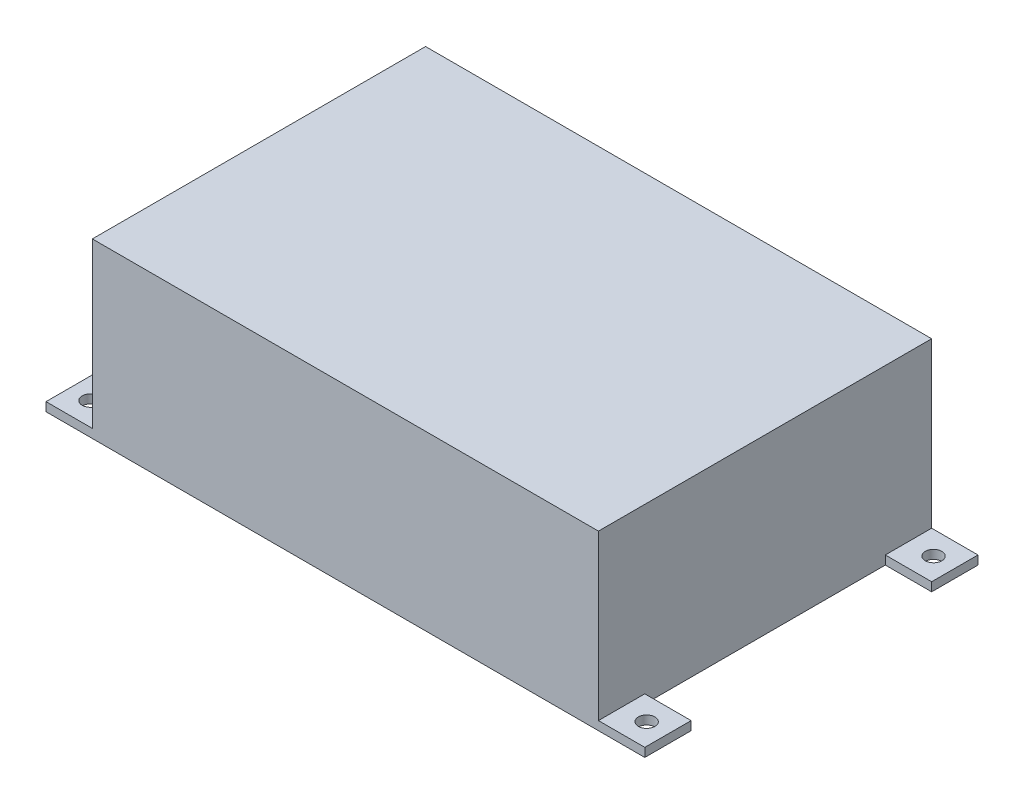
ISO-10303-21;
HEADER;
FILE_DESCRIPTION(('STEP AP214'),'2;1');
FILE_NAME('part.step','',(''),(''),'','','');
FILE_SCHEMA(('AUTOMOTIVE_DESIGN { 1 0 10303 214 1 1 1 1 }'));
ENDSEC;
DATA;
#1=APPLICATION_CONTEXT('core data for automotive mechanical design processes');
#2=APPLICATION_PROTOCOL_DEFINITION('international standard','automotive_design',2000,#1);
#3=PRODUCT_CONTEXT('',#1,'mechanical');
#4=PRODUCT('Part','Part','',(#3));
#5=PRODUCT_RELATED_PRODUCT_CATEGORY('part','',(#4));
#6=PRODUCT_DEFINITION_FORMATION('','',#4);
#7=PRODUCT_DEFINITION_CONTEXT('part definition',#1,'design');
#8=PRODUCT_DEFINITION('design','',#6,#7);
#9=PRODUCT_DEFINITION_SHAPE('','',#8);
#10=(LENGTH_UNIT() NAMED_UNIT(*) SI_UNIT(.MILLI.,.METRE.));
#11=(NAMED_UNIT(*) PLANE_ANGLE_UNIT() SI_UNIT($,.RADIAN.));
#12=(NAMED_UNIT(*) SI_UNIT($,.STERADIAN.) SOLID_ANGLE_UNIT());
#13=UNCERTAINTY_MEASURE_WITH_UNIT(LENGTH_MEASURE(1.E-05),#10,'distance_accuracy_value','');
#14=(GEOMETRIC_REPRESENTATION_CONTEXT(3) GLOBAL_UNCERTAINTY_ASSIGNED_CONTEXT((#13)) GLOBAL_UNIT_ASSIGNED_CONTEXT((#10,
#11,#12)) REPRESENTATION_CONTEXT('',''));
#15=CARTESIAN_POINT('',(0.,0.,0.));
#16=DIRECTION('',(0.,0.,1.));
#17=DIRECTION('',(1.,0.,0.));
#18=AXIS2_PLACEMENT_3D('',#15,#16,#17);
#19=CARTESIAN_POINT('',(202.,69.,0.));
#20=DIRECTION('',(-1.,0.,0.));
#21=DIRECTION('',(0.,0.,1.));
#22=AXIS2_PLACEMENT_3D('',#19,#20,#21);
#23=PLANE('',#22);
#24=DIRECTION('',(0.,-1.,0.));
#25=VECTOR('',#24,1.);
#26=CARTESIAN_POINT('',(202.,3.5,-114.5));
#27=LINE('',#26,#25);
#28=CARTESIAN_POINT('',(202.,3.5,-114.5));
#29=VERTEX_POINT('',#28);
#30=CARTESIAN_POINT('',(202.,0.,-114.5));
#31=VERTEX_POINT('',#30);
#32=EDGE_CURVE('E52',#29,#31,#27,.T.);
#33=ORIENTED_EDGE('',*,*,#32,.F.);
#34=DIRECTION('',(0.,0.,1.));
#35=VECTOR('',#34,1.);
#36=CARTESIAN_POINT('',(202.,3.5,-133.));
#37=LINE('',#36,#35);
#38=CARTESIAN_POINT('',(202.,3.5,-133.));
#39=VERTEX_POINT('',#38);
#40=EDGE_CURVE('E57',#39,#29,#37,.T.);
#41=ORIENTED_EDGE('',*,*,#40,.F.);
#42=DIRECTION('',(0.,-1.,0.));
#43=VECTOR('',#42,1.);
#44=CARTESIAN_POINT('',(202.,69.,-133.));
#45=LINE('',#44,#43);
#46=CARTESIAN_POINT('',(202.,69.,-133.));
#47=VERTEX_POINT('',#46);
#48=EDGE_CURVE('E301',#47,#39,#45,.T.);
#49=ORIENTED_EDGE('',*,*,#48,.F.);
#50=DIRECTION('',(0.,0.,-1.));
#51=VECTOR('',#50,1.);
#52=CARTESIAN_POINT('',(202.,69.,0.));
#53=LINE('',#52,#51);
#54=CARTESIAN_POINT('',(202.,69.,0.));
#55=VERTEX_POINT('',#54);
#56=EDGE_CURVE('E302',#55,#47,#53,.T.);
#57=ORIENTED_EDGE('',*,*,#56,.F.);
#58=DIRECTION('',(0.,-1.,0.));
#59=VECTOR('',#58,1.);
#60=CARTESIAN_POINT('',(202.,69.,0.));
#61=LINE('',#60,#59);
#62=CARTESIAN_POINT('',(202.,3.5,0.));
#63=VERTEX_POINT('',#62);
#64=EDGE_CURVE('E44',#55,#63,#61,.T.);
#65=ORIENTED_EDGE('',*,*,#64,.T.);
#66=DIRECTION('',(0.,0.,1.));
#67=VECTOR('',#66,1.);
#68=CARTESIAN_POINT('',(202.,3.5,0.));
#69=LINE('',#68,#67);
#70=CARTESIAN_POINT('',(202.,3.5,-18.5));
#71=VERTEX_POINT('',#70);
#72=EDGE_CURVE('E201',#71,#63,#69,.T.);
#73=ORIENTED_EDGE('',*,*,#72,.F.);
#74=DIRECTION('',(0.,-1.,0.));
#75=VECTOR('',#74,1.);
#76=CARTESIAN_POINT('',(202.,3.5,-18.5));
#77=LINE('',#76,#75);
#78=CARTESIAN_POINT('',(202.,0.,-18.5));
#79=VERTEX_POINT('',#78);
#80=EDGE_CURVE('E187',#71,#79,#77,.T.);
#81=ORIENTED_EDGE('',*,*,#80,.T.);
#82=DIRECTION('',(0.,0.,-1.));
#83=VECTOR('',#82,1.);
#84=CARTESIAN_POINT('',(202.,0.,0.));
#85=LINE('',#84,#83);
#86=EDGE_CURVE('E277',#79,#31,#85,.T.);
#87=ORIENTED_EDGE('',*,*,#86,.T.);
#88=EDGE_LOOP('',(#33,#41,#49,#57,#65,#73,#81,#87));
#89=FACE_BOUND('',#88,.T.);
#90=ADVANCED_FACE('F35',(#89),#23,.F.);
#91=CARTESIAN_POINT('',(0.,69.,0.));
#92=DIRECTION('',(1.,0.,0.));
#93=DIRECTION('',(0.,0.,-1.));
#94=AXIS2_PLACEMENT_3D('',#91,#92,#93);
#95=PLANE('',#94);
#96=DIRECTION('',(0.,-1.,0.));
#97=VECTOR('',#96,1.);
#98=CARTESIAN_POINT('',(0.,3.5,-18.5));
#99=LINE('',#98,#97);
#100=CARTESIAN_POINT('',(0.,3.5,-18.5));
#101=VERTEX_POINT('',#100);
#102=CARTESIAN_POINT('',(0.,0.,-18.5));
#103=VERTEX_POINT('',#102);
#104=EDGE_CURVE('E352',#101,#103,#99,.T.);
#105=ORIENTED_EDGE('',*,*,#104,.F.);
#106=DIRECTION('',(0.,0.,-1.));
#107=VECTOR('',#106,1.);
#108=CARTESIAN_POINT('',(0.,3.5,0.));
#109=LINE('',#108,#107);
#110=CARTESIAN_POINT('',(0.,3.5,0.));
#111=VERTEX_POINT('',#110);
#112=EDGE_CURVE('E333',#111,#101,#109,.T.);
#113=ORIENTED_EDGE('',*,*,#112,.F.);
#114=DIRECTION('',(0.,-1.,0.));
#115=VECTOR('',#114,1.);
#116=CARTESIAN_POINT('',(0.,69.,0.));
#117=LINE('',#116,#115);
#118=CARTESIAN_POINT('',(0.,69.,0.));
#119=VERTEX_POINT('',#118);
#120=EDGE_CURVE('E11',#119,#111,#117,.T.);
#121=ORIENTED_EDGE('',*,*,#120,.F.);
#122=DIRECTION('',(0.,0.,1.));
#123=VECTOR('',#122,1.);
#124=CARTESIAN_POINT('',(0.,69.,0.));
#125=LINE('',#124,#123);
#126=CARTESIAN_POINT('',(0.,69.,-133.));
#127=VERTEX_POINT('',#126);
#128=EDGE_CURVE('E309',#127,#119,#125,.T.);
#129=ORIENTED_EDGE('',*,*,#128,.F.);
#130=DIRECTION('',(0.,-1.,0.));
#131=VECTOR('',#130,1.);
#132=CARTESIAN_POINT('',(0.,69.,-133.));
#133=LINE('',#132,#131);
#134=CARTESIAN_POINT('',(0.,3.5,-133.));
#135=VERTEX_POINT('',#134);
#136=EDGE_CURVE('E307',#127,#135,#133,.T.);
#137=ORIENTED_EDGE('',*,*,#136,.T.);
#138=DIRECTION('',(0.,0.,-1.));
#139=VECTOR('',#138,1.);
#140=CARTESIAN_POINT('',(0.,3.5,-133.));
#141=LINE('',#140,#139);
#142=CARTESIAN_POINT('',(0.,3.5,-114.5));
#143=VERTEX_POINT('',#142);
#144=EDGE_CURVE('E379',#143,#135,#141,.T.);
#145=ORIENTED_EDGE('',*,*,#144,.F.);
#146=DIRECTION('',(0.,-1.,0.));
#147=VECTOR('',#146,1.);
#148=CARTESIAN_POINT('',(0.,3.5,-114.5));
#149=LINE('',#148,#147);
#150=CARTESIAN_POINT('',(0.,0.,-114.5));
#151=VERTEX_POINT('',#150);
#152=EDGE_CURVE('E321',#143,#151,#149,.T.);
#153=ORIENTED_EDGE('',*,*,#152,.T.);
#154=DIRECTION('',(0.,0.,1.));
#155=VECTOR('',#154,1.);
#156=CARTESIAN_POINT('',(0.,0.,0.));
#157=LINE('',#156,#155);
#158=EDGE_CURVE('E278',#151,#103,#157,.T.);
#159=ORIENTED_EDGE('',*,*,#158,.T.);
#160=EDGE_LOOP('',(#105,#113,#121,#129,#137,#145,#153,#159));
#161=FACE_BOUND('',#160,.T.);
#162=ADVANCED_FACE('F37',(#161),#95,.F.);
#163=CARTESIAN_POINT('',(0.,69.,0.));
#164=DIRECTION('',(0.,0.,-1.));
#165=DIRECTION('',(-1.,0.,0.));
#166=AXIS2_PLACEMENT_3D('',#163,#164,#165);
#167=PLANE('',#166);
#168=DIRECTION('',(1.,0.,0.));
#169=VECTOR('',#168,1.);
#170=CARTESIAN_POINT('',(0.,0.,0.));
#171=LINE('',#170,#169);
#172=CARTESIAN_POINT('',(-18.5,0.,0.));
#173=VERTEX_POINT('',#172);
#174=CARTESIAN_POINT('',(220.5,0.,0.));
#175=VERTEX_POINT('',#174);
#176=EDGE_CURVE('E266',#173,#175,#171,.T.);
#177=ORIENTED_EDGE('',*,*,#176,.T.);
#178=DIRECTION('',(0.,-1.,0.));
#179=VECTOR('',#178,1.);
#180=CARTESIAN_POINT('',(220.5,3.5,0.));
#181=LINE('',#180,#179);
#182=CARTESIAN_POINT('',(220.5,3.5,0.));
#183=VERTEX_POINT('',#182);
#184=EDGE_CURVE('E268',#183,#175,#181,.T.);
#185=ORIENTED_EDGE('',*,*,#184,.F.);
#186=DIRECTION('',(1.,0.,0.));
#187=VECTOR('',#186,1.);
#188=CARTESIAN_POINT('',(202.,3.5,0.));
#189=LINE('',#188,#187);
#190=EDGE_CURVE('E185',#63,#183,#189,.T.);
#191=ORIENTED_EDGE('',*,*,#190,.F.);
#192=ORIENTED_EDGE('',*,*,#64,.F.);
#193=DIRECTION('',(1.,0.,0.));
#194=VECTOR('',#193,1.);
#195=CARTESIAN_POINT('',(0.,69.,0.));
#196=LINE('',#195,#194);
#197=EDGE_CURVE('E299',#119,#55,#196,.T.);
#198=ORIENTED_EDGE('',*,*,#197,.F.);
#199=ORIENTED_EDGE('',*,*,#120,.T.);
#200=DIRECTION('',(1.,0.,0.));
#201=VECTOR('',#200,1.);
#202=CARTESIAN_POINT('',(0.,3.5,0.));
#203=LINE('',#202,#201);
#204=CARTESIAN_POINT('',(-18.5,3.5,0.));
#205=VERTEX_POINT('',#204);
#206=EDGE_CURVE('E335',#205,#111,#203,.T.);
#207=ORIENTED_EDGE('',*,*,#206,.F.);
#208=DIRECTION('',(0.,-1.,0.));
#209=VECTOR('',#208,1.);
#210=CARTESIAN_POINT('',(-18.5,3.5,0.));
#211=LINE('',#210,#209);
#212=EDGE_CURVE('E272',#205,#173,#211,.T.);
#213=ORIENTED_EDGE('',*,*,#212,.T.);
#214=EDGE_LOOP('',(#177,#185,#191,#192,#198,#199,#207,#213));
#215=FACE_BOUND('',#214,.T.);
#216=ADVANCED_FACE('F252',(#215),#167,.F.);
#217=CARTESIAN_POINT('',(0.,69.,-133.));
#218=DIRECTION('',(0.,0.,1.));
#219=DIRECTION('',(1.,0.,0.));
#220=AXIS2_PLACEMENT_3D('',#217,#218,#219);
#221=PLANE('',#220);
#222=DIRECTION('',(-1.,0.,0.));
#223=VECTOR('',#222,1.);
#224=CARTESIAN_POINT('',(0.,0.,-133.));
#225=LINE('',#224,#223);
#226=CARTESIAN_POINT('',(220.5,0.,-133.));
#227=VERTEX_POINT('',#226);
#228=CARTESIAN_POINT('',(-18.5,0.,-133.));
#229=VERTEX_POINT('',#228);
#230=EDGE_CURVE('E327',#227,#229,#225,.T.);
#231=ORIENTED_EDGE('',*,*,#230,.T.);
#232=DIRECTION('',(0.,-1.,0.));
#233=VECTOR('',#232,1.);
#234=CARTESIAN_POINT('',(-18.5,3.5,-133.));
#235=LINE('',#234,#233);
#236=CARTESIAN_POINT('',(-18.5,3.5,-133.));
#237=VERTEX_POINT('',#236);
#238=EDGE_CURVE('E317',#237,#229,#235,.T.);
#239=ORIENTED_EDGE('',*,*,#238,.F.);
#240=DIRECTION('',(-1.,0.,0.));
#241=VECTOR('',#240,1.);
#242=CARTESIAN_POINT('',(0.,3.5,-133.));
#243=LINE('',#242,#241);
#244=EDGE_CURVE('E359',#135,#237,#243,.T.);
#245=ORIENTED_EDGE('',*,*,#244,.F.);
#246=ORIENTED_EDGE('',*,*,#136,.F.);
#247=DIRECTION('',(-1.,0.,0.));
#248=VECTOR('',#247,1.);
#249=CARTESIAN_POINT('',(0.,69.,-133.));
#250=LINE('',#249,#248);
#251=EDGE_CURVE('E305',#47,#127,#250,.T.);
#252=ORIENTED_EDGE('',*,*,#251,.F.);
#253=ORIENTED_EDGE('',*,*,#48,.T.);
#254=DIRECTION('',(-1.,0.,0.));
#255=VECTOR('',#254,1.);
#256=CARTESIAN_POINT('',(202.,3.5,-133.));
#257=LINE('',#256,#255);
#258=CARTESIAN_POINT('',(220.5,3.5,-133.));
#259=VERTEX_POINT('',#258);
#260=EDGE_CURVE('E170',#259,#39,#257,.T.);
#261=ORIENTED_EDGE('',*,*,#260,.F.);
#262=DIRECTION('',(0.,-1.,0.));
#263=VECTOR('',#262,1.);
#264=CARTESIAN_POINT('',(220.5,3.5,-133.));
#265=LINE('',#264,#263);
#266=EDGE_CURVE('E165',#259,#227,#265,.T.);
#267=ORIENTED_EDGE('',*,*,#266,.T.);
#268=EDGE_LOOP('',(#231,#239,#245,#246,#252,#253,#261,#267));
#269=FACE_BOUND('',#268,.T.);
#270=ADVANCED_FACE('F255',(#269),#221,.F.);
#271=CARTESIAN_POINT('',(0.,69.,0.));
#272=DIRECTION('',(0.,-1.,0.));
#273=DIRECTION('',(0.,0.,-1.));
#274=AXIS2_PLACEMENT_3D('',#271,#272,#273);
#275=PLANE('',#274);
#276=ORIENTED_EDGE('',*,*,#128,.T.);
#277=ORIENTED_EDGE('',*,*,#197,.T.);
#278=ORIENTED_EDGE('',*,*,#56,.T.);
#279=ORIENTED_EDGE('',*,*,#251,.T.);
#280=EDGE_LOOP('',(#276,#277,#278,#279));
#281=FACE_BOUND('',#280,.T.);
#282=ADVANCED_FACE('F262',(#281),#275,.F.);
#283=CARTESIAN_POINT('',(0.,0.,0.));
#284=DIRECTION('',(0.,-1.,0.));
#285=DIRECTION('',(0.,0.,-1.));
#286=AXIS2_PLACEMENT_3D('',#283,#284,#285);
#287=PLANE('',#286);
#288=CARTESIAN_POINT('',(-9.99999999999998,0.,-123.75));
#289=DIRECTION('',(0.,-1.,0.));
#290=DIRECTION('',(0.,0.,-1.));
#291=AXIS2_PLACEMENT_3D('',#288,#289,#290);
#292=CIRCLE('',#291,3.29999999999999);
#293=CARTESIAN_POINT('',(-9.99999999999998,0.,-127.05));
#294=VERTEX_POINT('',#293);
#295=EDGE_CURVE('E39',#294,#294,#292,.T.);
#296=ORIENTED_EDGE('',*,*,#295,.F.);
#297=EDGE_LOOP('',(#296));
#298=FACE_BOUND('',#297,.T.);
#299=CARTESIAN_POINT('',(-9.99999999999998,0.,-9.24999999999998));
#300=DIRECTION('',(0.,-1.,0.));
#301=DIRECTION('',(0.,0.,-1.));
#302=AXIS2_PLACEMENT_3D('',#299,#300,#301);
#303=CIRCLE('',#302,3.29999999999999);
#304=CARTESIAN_POINT('',(-9.99999999999998,0.,-12.55));
#305=VERTEX_POINT('',#304);
#306=EDGE_CURVE('E217',#305,#305,#303,.T.);
#307=ORIENTED_EDGE('',*,*,#306,.F.);
#308=EDGE_LOOP('',(#307));
#309=FACE_BOUND('',#308,.T.);
#310=CARTESIAN_POINT('',(212.,0.,-9.24999999999998));
#311=DIRECTION('',(0.,-1.,0.));
#312=DIRECTION('',(0.,0.,-1.));
#313=AXIS2_PLACEMENT_3D('',#310,#311,#312);
#314=CIRCLE('',#313,3.3);
#315=CARTESIAN_POINT('',(212.,0.,-12.55));
#316=VERTEX_POINT('',#315);
#317=EDGE_CURVE('E214',#316,#316,#314,.T.);
#318=ORIENTED_EDGE('',*,*,#317,.F.);
#319=EDGE_LOOP('',(#318));
#320=FACE_BOUND('',#319,.T.);
#321=CARTESIAN_POINT('',(212.,0.,-123.75));
#322=DIRECTION('',(0.,-1.,0.));
#323=DIRECTION('',(0.,0.,-1.));
#324=AXIS2_PLACEMENT_3D('',#321,#322,#323);
#325=CIRCLE('',#324,3.3);
#326=CARTESIAN_POINT('',(212.,0.,-127.05));
#327=VERTEX_POINT('',#326);
#328=EDGE_CURVE('E177',#327,#327,#325,.T.);
#329=ORIENTED_EDGE('',*,*,#328,.F.);
#330=EDGE_LOOP('',(#329));
#331=FACE_BOUND('',#330,.T.);
#332=ORIENTED_EDGE('',*,*,#158,.F.);
#333=DIRECTION('',(1.,0.,0.));
#334=VECTOR('',#333,1.);
#335=CARTESIAN_POINT('',(0.,0.,-114.5));
#336=LINE('',#335,#334);
#337=CARTESIAN_POINT('',(-18.5,0.,-114.5));
#338=VERTEX_POINT('',#337);
#339=EDGE_CURVE('E361',#338,#151,#336,.T.);
#340=ORIENTED_EDGE('',*,*,#339,.F.);
#341=DIRECTION('',(0.,0.,1.));
#342=VECTOR('',#341,1.);
#343=CARTESIAN_POINT('',(-18.5,0.,-133.));
#344=LINE('',#343,#342);
#345=EDGE_CURVE('E355',#229,#338,#344,.T.);
#346=ORIENTED_EDGE('',*,*,#345,.F.);
#347=ORIENTED_EDGE('',*,*,#230,.F.);
#348=DIRECTION('',(0.,0.,-1.));
#349=VECTOR('',#348,1.);
#350=CARTESIAN_POINT('',(220.5,0.,-133.));
#351=LINE('',#350,#349);
#352=CARTESIAN_POINT('',(220.5,0.,-114.5));
#353=VERTEX_POINT('',#352);
#354=EDGE_CURVE('E176',#353,#227,#351,.T.);
#355=ORIENTED_EDGE('',*,*,#354,.F.);
#356=DIRECTION('',(1.,0.,0.));
#357=VECTOR('',#356,1.);
#358=CARTESIAN_POINT('',(202.,0.,-114.5));
#359=LINE('',#358,#357);
#360=EDGE_CURVE('E161',#31,#353,#359,.T.);
#361=ORIENTED_EDGE('',*,*,#360,.F.);
#362=ORIENTED_EDGE('',*,*,#86,.F.);
#363=DIRECTION('',(-1.,0.,0.));
#364=VECTOR('',#363,1.);
#365=CARTESIAN_POINT('',(202.,0.,-18.5));
#366=LINE('',#365,#364);
#367=CARTESIAN_POINT('',(220.5,0.,-18.5));
#368=VERTEX_POINT('',#367);
#369=EDGE_CURVE('E189',#368,#79,#366,.T.);
#370=ORIENTED_EDGE('',*,*,#369,.F.);
#371=DIRECTION('',(0.,0.,-1.));
#372=VECTOR('',#371,1.);
#373=CARTESIAN_POINT('',(220.5,0.,0.));
#374=LINE('',#373,#372);
#375=EDGE_CURVE('E181',#175,#368,#374,.T.);
#376=ORIENTED_EDGE('',*,*,#375,.F.);
#377=ORIENTED_EDGE('',*,*,#176,.F.);
#378=DIRECTION('',(0.,0.,1.));
#379=VECTOR('',#378,1.);
#380=CARTESIAN_POINT('',(-18.5,0.,0.));
#381=LINE('',#380,#379);
#382=CARTESIAN_POINT('',(-18.5,0.,-18.5));
#383=VERTEX_POINT('',#382);
#384=EDGE_CURVE('E348',#383,#173,#381,.T.);
#385=ORIENTED_EDGE('',*,*,#384,.F.);
#386=DIRECTION('',(-1.,0.,0.));
#387=VECTOR('',#386,1.);
#388=CARTESIAN_POINT('',(0.,0.,-18.5));
#389=LINE('',#388,#387);
#390=EDGE_CURVE('E284',#103,#383,#389,.T.);
#391=ORIENTED_EDGE('',*,*,#390,.F.);
#392=EDGE_LOOP('',(#332,#340,#346,#347,#355,#361,#362,#370,#376,#377,#385,#391));
#393=FACE_BOUND('',#392,.T.);
#394=ADVANCED_FACE('F287',(#298,#309,#320,#331,#393),#287,.T.);
#395=CARTESIAN_POINT('',(-18.5,3.5,-133.));
#396=DIRECTION('',(1.,0.,0.));
#397=DIRECTION('',(0.,0.,-1.));
#398=AXIS2_PLACEMENT_3D('',#395,#396,#397);
#399=PLANE('',#398);
#400=ORIENTED_EDGE('',*,*,#345,.T.);
#401=DIRECTION('',(0.,-1.,0.));
#402=VECTOR('',#401,1.);
#403=CARTESIAN_POINT('',(-18.5,3.5,-114.5));
#404=LINE('',#403,#402);
#405=CARTESIAN_POINT('',(-18.5,3.5,-114.5));
#406=VERTEX_POINT('',#405);
#407=EDGE_CURVE('E364',#406,#338,#404,.T.);
#408=ORIENTED_EDGE('',*,*,#407,.F.);
#409=DIRECTION('',(0.,0.,1.));
#410=VECTOR('',#409,1.);
#411=CARTESIAN_POINT('',(-18.5,3.5,-133.));
#412=LINE('',#411,#410);
#413=EDGE_CURVE('E356',#237,#406,#412,.T.);
#414=ORIENTED_EDGE('',*,*,#413,.F.);
#415=ORIENTED_EDGE('',*,*,#238,.T.);
#416=EDGE_LOOP('',(#400,#408,#414,#415));
#417=FACE_BOUND('',#416,.T.);
#418=ADVANCED_FACE('F372',(#417),#399,.F.);
#419=CARTESIAN_POINT('',(0.,3.5,-114.5));
#420=DIRECTION('',(0.,0.,-1.));
#421=DIRECTION('',(-1.,0.,0.));
#422=AXIS2_PLACEMENT_3D('',#419,#420,#421);
#423=PLANE('',#422);
#424=ORIENTED_EDGE('',*,*,#339,.T.);
#425=ORIENTED_EDGE('',*,*,#152,.F.);
#426=DIRECTION('',(1.,0.,0.));
#427=VECTOR('',#426,1.);
#428=CARTESIAN_POINT('',(0.,3.5,-114.5));
#429=LINE('',#428,#427);
#430=EDGE_CURVE('E358',#406,#143,#429,.T.);
#431=ORIENTED_EDGE('',*,*,#430,.F.);
#432=ORIENTED_EDGE('',*,*,#407,.T.);
#433=EDGE_LOOP('',(#424,#425,#431,#432));
#434=FACE_BOUND('',#433,.T.);
#435=ADVANCED_FACE('F394',(#434),#423,.F.);
#436=CARTESIAN_POINT('',(0.,3.5,0.));
#437=DIRECTION('',(0.,-1.,0.));
#438=DIRECTION('',(0.,0.,-1.));
#439=AXIS2_PLACEMENT_3D('',#436,#437,#438);
#440=PLANE('',#439);
#441=CARTESIAN_POINT('',(-9.99999999999998,3.5,-123.75));
#442=DIRECTION('',(0.,1.,0.));
#443=DIRECTION('',(0.,0.,1.));
#444=AXIS2_PLACEMENT_3D('',#441,#442,#443);
#445=CIRCLE('',#444,3.29999999999999);
#446=CARTESIAN_POINT('',(-9.99999999999998,3.5,-120.45));
#447=VERTEX_POINT('',#446);
#448=EDGE_CURVE('E229',#447,#447,#445,.T.);
#449=ORIENTED_EDGE('',*,*,#448,.F.);
#450=EDGE_LOOP('',(#449));
#451=FACE_BOUND('',#450,.T.);
#452=ORIENTED_EDGE('',*,*,#144,.T.);
#453=ORIENTED_EDGE('',*,*,#244,.T.);
#454=ORIENTED_EDGE('',*,*,#413,.T.);
#455=ORIENTED_EDGE('',*,*,#430,.T.);
#456=EDGE_LOOP('',(#452,#453,#454,#455));
#457=FACE_BOUND('',#456,.T.);
#458=ADVANCED_FACE('F391',(#451,#457),#440,.F.);
#459=CARTESIAN_POINT('',(0.,3.5,-18.5));
#460=DIRECTION('',(0.,0.,1.));
#461=DIRECTION('',(1.,0.,0.));
#462=AXIS2_PLACEMENT_3D('',#459,#460,#461);
#463=PLANE('',#462);
#464=ORIENTED_EDGE('',*,*,#390,.T.);
#465=DIRECTION('',(0.,-1.,0.));
#466=VECTOR('',#465,1.);
#467=CARTESIAN_POINT('',(-18.5,3.5,-18.5));
#468=LINE('',#467,#466);
#469=CARTESIAN_POINT('',(-18.5,3.5,-18.5));
#470=VERTEX_POINT('',#469);
#471=EDGE_CURVE('E341',#470,#383,#468,.T.);
#472=ORIENTED_EDGE('',*,*,#471,.F.);
#473=DIRECTION('',(-1.,0.,0.));
#474=VECTOR('',#473,1.);
#475=CARTESIAN_POINT('',(0.,3.5,-18.5));
#476=LINE('',#475,#474);
#477=EDGE_CURVE('E343',#101,#470,#476,.T.);
#478=ORIENTED_EDGE('',*,*,#477,.F.);
#479=ORIENTED_EDGE('',*,*,#104,.T.);
#480=EDGE_LOOP('',(#464,#472,#478,#479));
#481=FACE_BOUND('',#480,.T.);
#482=ADVANCED_FACE('F401',(#481),#463,.F.);
#483=CARTESIAN_POINT('',(-18.5,3.5,0.));
#484=DIRECTION('',(1.,0.,0.));
#485=DIRECTION('',(0.,0.,-1.));
#486=AXIS2_PLACEMENT_3D('',#483,#484,#485);
#487=PLANE('',#486);
#488=ORIENTED_EDGE('',*,*,#384,.T.);
#489=ORIENTED_EDGE('',*,*,#212,.F.);
#490=DIRECTION('',(0.,0.,1.));
#491=VECTOR('',#490,1.);
#492=CARTESIAN_POINT('',(-18.5,3.5,0.));
#493=LINE('',#492,#491);
#494=EDGE_CURVE('E339',#470,#205,#493,.T.);
#495=ORIENTED_EDGE('',*,*,#494,.F.);
#496=ORIENTED_EDGE('',*,*,#471,.T.);
#497=EDGE_LOOP('',(#488,#489,#495,#496));
#498=FACE_BOUND('',#497,.T.);
#499=ADVANCED_FACE('F438',(#498),#487,.F.);
#500=CARTESIAN_POINT('',(0.,3.5,0.));
#501=DIRECTION('',(0.,1.,0.));
#502=DIRECTION('',(0.,0.,1.));
#503=AXIS2_PLACEMENT_3D('',#500,#501,#502);
#504=PLANE('',#503);
#505=CARTESIAN_POINT('',(-9.99999999999998,3.5,-9.24999999999998));
#506=DIRECTION('',(0.,1.,0.));
#507=DIRECTION('',(0.,0.,1.));
#508=AXIS2_PLACEMENT_3D('',#505,#506,#507);
#509=CIRCLE('',#508,3.29999999999999);
#510=CARTESIAN_POINT('',(-9.99999999999998,3.5,-5.95));
#511=VERTEX_POINT('',#510);
#512=EDGE_CURVE('E219',#511,#511,#509,.T.);
#513=ORIENTED_EDGE('',*,*,#512,.F.);
#514=EDGE_LOOP('',(#513));
#515=FACE_BOUND('',#514,.T.);
#516=ORIENTED_EDGE('',*,*,#112,.T.);
#517=ORIENTED_EDGE('',*,*,#477,.T.);
#518=ORIENTED_EDGE('',*,*,#494,.T.);
#519=ORIENTED_EDGE('',*,*,#206,.T.);
#520=EDGE_LOOP('',(#516,#517,#518,#519));
#521=FACE_BOUND('',#520,.T.);
#522=ADVANCED_FACE('F337',(#515,#521),#504,.T.);
#523=CARTESIAN_POINT('',(220.5,3.5,0.));
#524=DIRECTION('',(-1.,0.,0.));
#525=DIRECTION('',(0.,0.,1.));
#526=AXIS2_PLACEMENT_3D('',#523,#524,#525);
#527=PLANE('',#526);
#528=ORIENTED_EDGE('',*,*,#375,.T.);
#529=DIRECTION('',(0.,-1.,0.));
#530=VECTOR('',#529,1.);
#531=CARTESIAN_POINT('',(220.5,3.5,-18.5));
#532=LINE('',#531,#530);
#533=CARTESIAN_POINT('',(220.5,3.5,-18.5));
#534=VERTEX_POINT('',#533);
#535=EDGE_CURVE('E192',#534,#368,#532,.T.);
#536=ORIENTED_EDGE('',*,*,#535,.F.);
#537=DIRECTION('',(0.,0.,-1.));
#538=VECTOR('',#537,1.);
#539=CARTESIAN_POINT('',(220.5,3.5,0.));
#540=LINE('',#539,#538);
#541=EDGE_CURVE('E182',#183,#534,#540,.T.);
#542=ORIENTED_EDGE('',*,*,#541,.F.);
#543=ORIENTED_EDGE('',*,*,#184,.T.);
#544=EDGE_LOOP('',(#528,#536,#542,#543));
#545=FACE_BOUND('',#544,.T.);
#546=ADVANCED_FACE('F281',(#545),#527,.F.);
#547=CARTESIAN_POINT('',(202.,3.5,-18.5));
#548=DIRECTION('',(0.,0.,1.));
#549=DIRECTION('',(1.,0.,0.));
#550=AXIS2_PLACEMENT_3D('',#547,#548,#549);
#551=PLANE('',#550);
#552=ORIENTED_EDGE('',*,*,#369,.T.);
#553=ORIENTED_EDGE('',*,*,#80,.F.);
#554=DIRECTION('',(-1.,0.,0.));
#555=VECTOR('',#554,1.);
#556=CARTESIAN_POINT('',(202.,3.5,-18.5));
#557=LINE('',#556,#555);
#558=EDGE_CURVE('E184',#534,#71,#557,.T.);
#559=ORIENTED_EDGE('',*,*,#558,.F.);
#560=ORIENTED_EDGE('',*,*,#535,.T.);
#561=EDGE_LOOP('',(#552,#553,#559,#560));
#562=FACE_BOUND('',#561,.T.);
#563=ADVANCED_FACE('F291',(#562),#551,.F.);
#564=CARTESIAN_POINT('',(0.,3.5,0.));
#565=DIRECTION('',(0.,-1.,0.));
#566=DIRECTION('',(0.,0.,-1.));
#567=AXIS2_PLACEMENT_3D('',#564,#565,#566);
#568=PLANE('',#567);
#569=CARTESIAN_POINT('',(212.,3.5,-9.24999999999998));
#570=DIRECTION('',(0.,1.,0.));
#571=DIRECTION('',(0.,0.,1.));
#572=AXIS2_PLACEMENT_3D('',#569,#570,#571);
#573=CIRCLE('',#572,3.3);
#574=CARTESIAN_POINT('',(212.,3.5,-5.94999999999999));
#575=VERTEX_POINT('',#574);
#576=EDGE_CURVE('E216',#575,#575,#573,.T.);
#577=ORIENTED_EDGE('',*,*,#576,.F.);
#578=EDGE_LOOP('',(#577));
#579=FACE_BOUND('',#578,.T.);
#580=ORIENTED_EDGE('',*,*,#72,.T.);
#581=ORIENTED_EDGE('',*,*,#190,.T.);
#582=ORIENTED_EDGE('',*,*,#541,.T.);
#583=ORIENTED_EDGE('',*,*,#558,.T.);
#584=EDGE_LOOP('',(#580,#581,#582,#583));
#585=FACE_BOUND('',#584,.T.);
#586=ADVANCED_FACE('F298',(#579,#585),#568,.F.);
#587=CARTESIAN_POINT('',(202.,3.5,-114.5));
#588=DIRECTION('',(0.,0.,-1.));
#589=DIRECTION('',(-1.,0.,0.));
#590=AXIS2_PLACEMENT_3D('',#587,#588,#589);
#591=PLANE('',#590);
#592=ORIENTED_EDGE('',*,*,#360,.T.);
#593=DIRECTION('',(0.,-1.,0.));
#594=VECTOR('',#593,1.);
#595=CARTESIAN_POINT('',(220.5,3.5,-114.5));
#596=LINE('',#595,#594);
#597=CARTESIAN_POINT('',(220.5,3.5,-114.5));
#598=VERTEX_POINT('',#597);
#599=EDGE_CURVE('E158',#598,#353,#596,.T.);
#600=ORIENTED_EDGE('',*,*,#599,.F.);
#601=DIRECTION('',(1.,0.,0.));
#602=VECTOR('',#601,1.);
#603=CARTESIAN_POINT('',(202.,3.5,-114.5));
#604=LINE('',#603,#602);
#605=EDGE_CURVE('E148',#29,#598,#604,.T.);
#606=ORIENTED_EDGE('',*,*,#605,.F.);
#607=ORIENTED_EDGE('',*,*,#32,.T.);
#608=EDGE_LOOP('',(#592,#600,#606,#607));
#609=FACE_BOUND('',#608,.T.);
#610=ADVANCED_FACE('F159',(#609),#591,.F.);
#611=CARTESIAN_POINT('',(220.5,3.5,-133.));
#612=DIRECTION('',(-1.,0.,0.));
#613=DIRECTION('',(0.,0.,1.));
#614=AXIS2_PLACEMENT_3D('',#611,#612,#613);
#615=PLANE('',#614);
#616=ORIENTED_EDGE('',*,*,#354,.T.);
#617=ORIENTED_EDGE('',*,*,#266,.F.);
#618=DIRECTION('',(0.,0.,-1.));
#619=VECTOR('',#618,1.);
#620=CARTESIAN_POINT('',(220.5,3.5,-133.));
#621=LINE('',#620,#619);
#622=EDGE_CURVE('E153',#598,#259,#621,.T.);
#623=ORIENTED_EDGE('',*,*,#622,.F.);
#624=ORIENTED_EDGE('',*,*,#599,.T.);
#625=EDGE_LOOP('',(#616,#617,#623,#624));
#626=FACE_BOUND('',#625,.T.);
#627=ADVANCED_FACE('F167',(#626),#615,.F.);
#628=CARTESIAN_POINT('',(0.,3.5,0.));
#629=DIRECTION('',(0.,1.,0.));
#630=DIRECTION('',(0.,0.,1.));
#631=AXIS2_PLACEMENT_3D('',#628,#629,#630);
#632=PLANE('',#631);
#633=CARTESIAN_POINT('',(212.,3.5,-123.75));
#634=DIRECTION('',(0.,1.,0.));
#635=DIRECTION('',(0.,0.,1.));
#636=AXIS2_PLACEMENT_3D('',#633,#634,#635);
#637=CIRCLE('',#636,3.3);
#638=CARTESIAN_POINT('',(212.,3.5,-120.45));
#639=VERTEX_POINT('',#638);
#640=EDGE_CURVE('E213',#639,#639,#637,.T.);
#641=ORIENTED_EDGE('',*,*,#640,.F.);
#642=EDGE_LOOP('',(#641));
#643=FACE_BOUND('',#642,.T.);
#644=ORIENTED_EDGE('',*,*,#40,.T.);
#645=ORIENTED_EDGE('',*,*,#605,.T.);
#646=ORIENTED_EDGE('',*,*,#622,.T.);
#647=ORIENTED_EDGE('',*,*,#260,.T.);
#648=EDGE_LOOP('',(#644,#645,#646,#647));
#649=FACE_BOUND('',#648,.T.);
#650=ADVANCED_FACE('F150',(#643,#649),#632,.T.);
#651=CARTESIAN_POINT('',(212.,3.5,-123.75));
#652=DIRECTION('',(0.,1.,0.));
#653=DIRECTION('',(0.,0.,1.));
#654=AXIS2_PLACEMENT_3D('',#651,#652,#653);
#655=CYLINDRICAL_SURFACE('',#654,3.3);
#656=ORIENTED_EDGE('',*,*,#328,.T.);
#657=EDGE_LOOP('',(#656));
#658=FACE_BOUND('',#657,.T.);
#659=ORIENTED_EDGE('',*,*,#640,.T.);
#660=EDGE_LOOP('',(#659));
#661=FACE_BOUND('',#660,.T.);
#662=ADVANCED_FACE('F235',(#658,#661),#655,.F.);
#663=CARTESIAN_POINT('',(212.,3.5,-9.24999999999998));
#664=DIRECTION('',(0.,1.,0.));
#665=DIRECTION('',(0.,0.,1.));
#666=AXIS2_PLACEMENT_3D('',#663,#664,#665);
#667=CYLINDRICAL_SURFACE('',#666,3.3);
#668=ORIENTED_EDGE('',*,*,#317,.T.);
#669=EDGE_LOOP('',(#668));
#670=FACE_BOUND('',#669,.T.);
#671=ORIENTED_EDGE('',*,*,#576,.T.);
#672=EDGE_LOOP('',(#671));
#673=FACE_BOUND('',#672,.T.);
#674=ADVANCED_FACE('F243',(#670,#673),#667,.F.);
#675=CARTESIAN_POINT('',(-9.99999999999998,3.5,-9.24999999999998));
#676=DIRECTION('',(0.,1.,0.));
#677=DIRECTION('',(0.,0.,1.));
#678=AXIS2_PLACEMENT_3D('',#675,#676,#677);
#679=CYLINDRICAL_SURFACE('',#678,3.29999999999999);
#680=ORIENTED_EDGE('',*,*,#306,.T.);
#681=EDGE_LOOP('',(#680));
#682=FACE_BOUND('',#681,.T.);
#683=ORIENTED_EDGE('',*,*,#512,.T.);
#684=EDGE_LOOP('',(#683));
#685=FACE_BOUND('',#684,.T.);
#686=ADVANCED_FACE('F421',(#682,#685),#679,.F.);
#687=CARTESIAN_POINT('',(-9.99999999999998,3.5,-123.75));
#688=DIRECTION('',(0.,1.,0.));
#689=DIRECTION('',(0.,0.,1.));
#690=AXIS2_PLACEMENT_3D('',#687,#688,#689);
#691=CYLINDRICAL_SURFACE('',#690,3.29999999999999);
#692=ORIENTED_EDGE('',*,*,#295,.T.);
#693=EDGE_LOOP('',(#692));
#694=FACE_BOUND('',#693,.T.);
#695=ORIENTED_EDGE('',*,*,#448,.T.);
#696=EDGE_LOOP('',(#695));
#697=FACE_BOUND('',#696,.T.);
#698=ADVANCED_FACE('F580',(#694,#697),#691,.F.);
#699=CLOSED_SHELL('',(#90,#162,#216,#270,#282,#394,#418,#435,#458,#482,#499,#522,#546,#563,#586,
#610,#627,#650,#662,#674,#686,#698));
#700=MANIFOLD_SOLID_BREP('B2',#699);
#701=ADVANCED_BREP_SHAPE_REPRESENTATION('',(#18,#700),#14);
#702=SHAPE_DEFINITION_REPRESENTATION(#9,#701);
ENDSEC;
END-ISO-10303-21;
